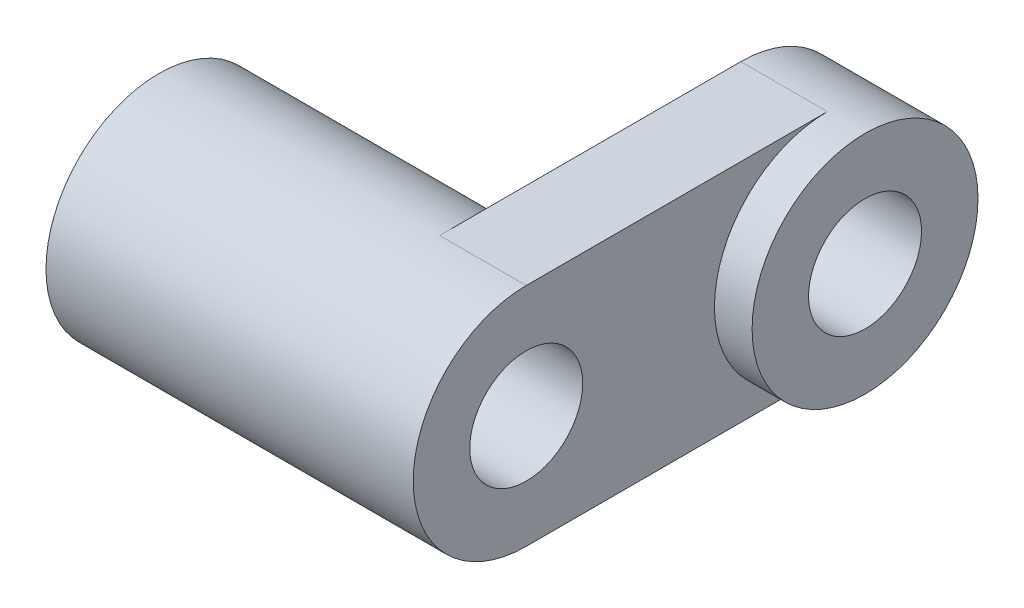
ISO-10303-21;
HEADER;
FILE_DESCRIPTION(('STEP AP214'),'2;1');
FILE_NAME('part.step','',(''),(''),'','','');
FILE_SCHEMA(('AUTOMOTIVE_DESIGN { 1 0 10303 214 1 1 1 1 }'));
ENDSEC;
DATA;
#1=APPLICATION_CONTEXT('core data for automotive mechanical design processes');
#2=APPLICATION_PROTOCOL_DEFINITION('international standard','automotive_design',2000,#1);
#3=PRODUCT_CONTEXT('',#1,'mechanical');
#4=PRODUCT('Part','Part','',(#3));
#5=PRODUCT_RELATED_PRODUCT_CATEGORY('part','',(#4));
#6=PRODUCT_DEFINITION_FORMATION('','',#4);
#7=PRODUCT_DEFINITION_CONTEXT('part definition',#1,'design');
#8=PRODUCT_DEFINITION('design','',#6,#7);
#9=PRODUCT_DEFINITION_SHAPE('','',#8);
#10=(LENGTH_UNIT() NAMED_UNIT(*) SI_UNIT(.MILLI.,.METRE.));
#11=(NAMED_UNIT(*) PLANE_ANGLE_UNIT() SI_UNIT($,.RADIAN.));
#12=(NAMED_UNIT(*) SI_UNIT($,.STERADIAN.) SOLID_ANGLE_UNIT());
#13=UNCERTAINTY_MEASURE_WITH_UNIT(LENGTH_MEASURE(1.E-05),#10,'distance_accuracy_value','');
#14=(GEOMETRIC_REPRESENTATION_CONTEXT(3) GLOBAL_UNCERTAINTY_ASSIGNED_CONTEXT((#13)) GLOBAL_UNIT_ASSIGNED_CONTEXT((#10,
#11,#12)) REPRESENTATION_CONTEXT('',''));
#15=CARTESIAN_POINT('',(0.,0.,0.));
#16=DIRECTION('',(0.,0.,1.));
#17=DIRECTION('',(1.,0.,0.));
#18=AXIS2_PLACEMENT_3D('',#15,#16,#17);
#19=CARTESIAN_POINT('',(0.,0.,0.));
#20=DIRECTION('',(1.,0.,0.));
#21=DIRECTION('',(0.,0.,-1.));
#22=AXIS2_PLACEMENT_3D('',#19,#20,#21);
#23=PLANE('',#22);
#24=CARTESIAN_POINT('',(0.,0.,-8.));
#25=DIRECTION('',(1.,0.,0.));
#26=DIRECTION('',(0.,0.,-1.));
#27=AXIS2_PLACEMENT_3D('',#24,#25,#26);
#28=CIRCLE('',#27,1.5);
#29=CARTESIAN_POINT('',(0.,0.,-9.50000000000001));
#30=VERTEX_POINT('',#29);
#31=EDGE_CURVE('E137',#30,#30,#28,.T.);
#32=ORIENTED_EDGE('',*,*,#31,.T.);
#33=EDGE_LOOP('',(#32));
#34=FACE_BOUND('',#33,.T.);
#35=CARTESIAN_POINT('',(0.,0.,0.));
#36=DIRECTION('',(-1.,0.,0.));
#37=DIRECTION('',(0.,0.,1.));
#38=AXIS2_PLACEMENT_3D('',#35,#36,#37);
#39=CIRCLE('',#38,3.);
#40=CARTESIAN_POINT('',(0.,3.,0.));
#41=VERTEX_POINT('',#40);
#42=CARTESIAN_POINT('',(0.,-3.,0.));
#43=VERTEX_POINT('',#42);
#44=EDGE_CURVE('E134',#41,#43,#39,.T.);
#45=ORIENTED_EDGE('',*,*,#44,.F.);
#46=DIRECTION('',(0.,0.,1.));
#47=VECTOR('',#46,1.);
#48=CARTESIAN_POINT('',(0.,3.,0.));
#49=LINE('',#48,#47);
#50=CARTESIAN_POINT('',(0.,3.,-8.));
#51=VERTEX_POINT('',#50);
#52=EDGE_CURVE('E123',#51,#41,#49,.T.);
#53=ORIENTED_EDGE('',*,*,#52,.F.);
#54=CARTESIAN_POINT('',(0.,0.,-8.));
#55=DIRECTION('',(1.,0.,0.));
#56=DIRECTION('',(0.,0.,-1.));
#57=AXIS2_PLACEMENT_3D('',#54,#55,#56);
#58=CIRCLE('',#57,3.);
#59=CARTESIAN_POINT('',(0.,-3.,-8.));
#60=VERTEX_POINT('',#59);
#61=EDGE_CURVE('E75',#60,#51,#58,.T.);
#62=ORIENTED_EDGE('',*,*,#61,.F.);
#63=DIRECTION('',(0.,0.,-1.));
#64=VECTOR('',#63,1.);
#65=CARTESIAN_POINT('',(0.,-3.,0.));
#66=LINE('',#65,#64);
#67=EDGE_CURVE('E69',#43,#60,#66,.T.);
#68=ORIENTED_EDGE('',*,*,#67,.F.);
#69=EDGE_LOOP('',(#45,#53,#62,#68));
#70=FACE_BOUND('',#69,.T.);
#71=ADVANCED_FACE('F35',(#34,#70),#23,.F.);
#72=CARTESIAN_POINT('',(2.3,0.,0.));
#73=DIRECTION('',(1.,0.,0.));
#74=DIRECTION('',(0.,0.,-1.));
#75=AXIS2_PLACEMENT_3D('',#72,#73,#74);
#76=PLANE('',#75);
#77=CARTESIAN_POINT('',(2.3,0.,-8.));
#78=DIRECTION('',(1.,0.,0.));
#79=DIRECTION('',(0.,0.,-1.));
#80=AXIS2_PLACEMENT_3D('',#77,#78,#79);
#81=CIRCLE('',#80,3.);
#82=CARTESIAN_POINT('',(2.3,3.,-8.));
#83=VERTEX_POINT('',#82);
#84=CARTESIAN_POINT('',(2.3,-3.,-8.));
#85=VERTEX_POINT('',#84);
#86=EDGE_CURVE('E95',#83,#85,#81,.T.);
#87=ORIENTED_EDGE('',*,*,#86,.F.);
#88=DIRECTION('',(0.,0.,1.));
#89=VECTOR('',#88,1.);
#90=CARTESIAN_POINT('',(2.3,3.,0.));
#91=LINE('',#90,#89);
#92=CARTESIAN_POINT('',(2.3,3.,0.));
#93=VERTEX_POINT('',#92);
#94=EDGE_CURVE('E54',#83,#93,#91,.T.);
#95=ORIENTED_EDGE('',*,*,#94,.T.);
#96=CARTESIAN_POINT('',(2.3,0.,0.));
#97=DIRECTION('',(1.,0.,0.));
#98=DIRECTION('',(0.,0.,-1.));
#99=AXIS2_PLACEMENT_3D('',#96,#97,#98);
#100=CIRCLE('',#99,3.);
#101=CARTESIAN_POINT('',(2.3,-3.,0.));
#102=VERTEX_POINT('',#101);
#103=EDGE_CURVE('E120',#93,#102,#100,.T.);
#104=ORIENTED_EDGE('',*,*,#103,.T.);
#105=DIRECTION('',(0.,0.,-1.));
#106=VECTOR('',#105,1.);
#107=CARTESIAN_POINT('',(2.3,-3.,0.));
#108=LINE('',#107,#106);
#109=EDGE_CURVE('E78',#102,#85,#108,.T.);
#110=ORIENTED_EDGE('',*,*,#109,.T.);
#111=EDGE_LOOP('',(#87,#95,#104,#110));
#112=FACE_BOUND('',#111,.T.);
#113=CARTESIAN_POINT('',(2.3,0.,0.));
#114=DIRECTION('',(1.,0.,0.));
#115=DIRECTION('',(0.,0.,-1.));
#116=AXIS2_PLACEMENT_3D('',#113,#114,#115);
#117=CIRCLE('',#116,1.5);
#118=CARTESIAN_POINT('',(2.3,0.,-1.5));
#119=VERTEX_POINT('',#118);
#120=EDGE_CURVE('E126',#119,#119,#117,.T.);
#121=ORIENTED_EDGE('',*,*,#120,.F.);
#122=EDGE_LOOP('',(#121));
#123=FACE_BOUND('',#122,.T.);
#124=ADVANCED_FACE('F97',(#112,#123),#76,.T.);
#125=CARTESIAN_POINT('',(2.3,0.,0.));
#126=DIRECTION('',(-1.,0.,0.));
#127=DIRECTION('',(0.,0.,1.));
#128=AXIS2_PLACEMENT_3D('',#125,#126,#127);
#129=CYLINDRICAL_SURFACE('',#128,3.);
#130=DIRECTION('',(-1.,0.,0.));
#131=VECTOR('',#130,1.);
#132=CARTESIAN_POINT('',(2.3,3.,0.));
#133=LINE('',#132,#131);
#134=EDGE_CURVE('E89',#93,#41,#133,.T.);
#135=ORIENTED_EDGE('',*,*,#134,.T.);
#136=ORIENTED_EDGE('',*,*,#44,.T.);
#137=DIRECTION('',(-1.,0.,0.));
#138=VECTOR('',#137,1.);
#139=CARTESIAN_POINT('',(2.3,-3.,0.));
#140=LINE('',#139,#138);
#141=EDGE_CURVE('E12',#102,#43,#140,.T.);
#142=ORIENTED_EDGE('',*,*,#141,.F.);
#143=ORIENTED_EDGE('',*,*,#103,.F.);
#144=EDGE_LOOP('',(#135,#136,#142,#143));
#145=FACE_BOUND('',#144,.T.);
#146=CARTESIAN_POINT('',(-7.455,0.,0.));
#147=DIRECTION('',(1.,0.,0.));
#148=DIRECTION('',(0.,0.,-1.));
#149=AXIS2_PLACEMENT_3D('',#146,#147,#148);
#150=CIRCLE('',#149,3.);
#151=CARTESIAN_POINT('',(-7.455,0.,-3.));
#152=VERTEX_POINT('',#151);
#153=EDGE_CURVE('E103',#152,#152,#150,.T.);
#154=ORIENTED_EDGE('',*,*,#153,.T.);
#155=EDGE_LOOP('',(#154));
#156=FACE_BOUND('',#155,.T.);
#157=ADVANCED_FACE('F37',(#145,#156),#129,.T.);
#158=CARTESIAN_POINT('',(2.3,-3.,0.));
#159=DIRECTION('',(0.,1.,0.));
#160=DIRECTION('',(0.,0.,1.));
#161=AXIS2_PLACEMENT_3D('',#158,#159,#160);
#162=PLANE('',#161);
#163=ORIENTED_EDGE('',*,*,#67,.T.);
#164=DIRECTION('',(-1.,0.,0.));
#165=VECTOR('',#164,1.);
#166=CARTESIAN_POINT('',(2.3,-3.,-8.));
#167=LINE('',#166,#165);
#168=EDGE_CURVE('E45',#85,#60,#167,.T.);
#169=ORIENTED_EDGE('',*,*,#168,.F.);
#170=ORIENTED_EDGE('',*,*,#109,.F.);
#171=ORIENTED_EDGE('',*,*,#141,.T.);
#172=EDGE_LOOP('',(#163,#169,#170,#171));
#173=FACE_BOUND('',#172,.T.);
#174=ADVANCED_FACE('F150',(#173),#162,.F.);
#175=CARTESIAN_POINT('',(2.3,0.,-8.));
#176=DIRECTION('',(-1.,0.,0.));
#177=DIRECTION('',(0.,0.,1.));
#178=AXIS2_PLACEMENT_3D('',#175,#176,#177);
#179=CYLINDRICAL_SURFACE('',#178,3.);
#180=ORIENTED_EDGE('',*,*,#61,.T.);
#181=DIRECTION('',(-1.,0.,0.));
#182=VECTOR('',#181,1.);
#183=CARTESIAN_POINT('',(2.3,3.,-8.));
#184=LINE('',#183,#182);
#185=EDGE_CURVE('E86',#83,#51,#184,.T.);
#186=ORIENTED_EDGE('',*,*,#185,.F.);
#187=ORIENTED_EDGE('',*,*,#86,.T.);
#188=ORIENTED_EDGE('',*,*,#168,.T.);
#189=EDGE_LOOP('',(#180,#186,#187,#188));
#190=FACE_BOUND('',#189,.T.);
#191=CARTESIAN_POINT('',(3.3,0.,-8.));
#192=DIRECTION('',(1.,0.,0.));
#193=DIRECTION('',(0.,0.,-1.));
#194=AXIS2_PLACEMENT_3D('',#191,#192,#193);
#195=CIRCLE('',#194,3.);
#196=CARTESIAN_POINT('',(3.3,0.,-11.));
#197=VERTEX_POINT('',#196);
#198=EDGE_CURVE('E99',#197,#197,#195,.T.);
#199=ORIENTED_EDGE('',*,*,#198,.F.);
#200=EDGE_LOOP('',(#199));
#201=FACE_BOUND('',#200,.T.);
#202=ADVANCED_FACE('F93',(#190,#201),#179,.T.);
#203=CARTESIAN_POINT('',(2.3,3.,0.));
#204=DIRECTION('',(0.,-1.,0.));
#205=DIRECTION('',(0.,0.,-1.));
#206=AXIS2_PLACEMENT_3D('',#203,#204,#205);
#207=PLANE('',#206);
#208=ORIENTED_EDGE('',*,*,#52,.T.);
#209=ORIENTED_EDGE('',*,*,#134,.F.);
#210=ORIENTED_EDGE('',*,*,#94,.F.);
#211=ORIENTED_EDGE('',*,*,#185,.T.);
#212=EDGE_LOOP('',(#208,#209,#210,#211));
#213=FACE_BOUND('',#212,.T.);
#214=ADVANCED_FACE('F85',(#213),#207,.F.);
#215=CARTESIAN_POINT('',(2.3,0.,0.));
#216=DIRECTION('',(-1.,0.,0.));
#217=DIRECTION('',(0.,0.,1.));
#218=AXIS2_PLACEMENT_3D('',#215,#216,#217);
#219=CYLINDRICAL_SURFACE('',#218,1.5);
#220=ORIENTED_EDGE('',*,*,#120,.T.);
#221=EDGE_LOOP('',(#220));
#222=FACE_BOUND('',#221,.T.);
#223=CARTESIAN_POINT('',(-7.455,0.,0.));
#224=DIRECTION('',(1.,0.,0.));
#225=DIRECTION('',(0.,0.,-1.));
#226=AXIS2_PLACEMENT_3D('',#223,#224,#225);
#227=CIRCLE('',#226,1.5);
#228=CARTESIAN_POINT('',(-7.455,0.,-1.5));
#229=VERTEX_POINT('',#228);
#230=EDGE_CURVE('E136',#229,#229,#227,.T.);
#231=ORIENTED_EDGE('',*,*,#230,.F.);
#232=EDGE_LOOP('',(#231));
#233=FACE_BOUND('',#232,.T.);
#234=ADVANCED_FACE('F142',(#222,#233),#219,.F.);
#235=CARTESIAN_POINT('',(2.3,0.,-8.));
#236=DIRECTION('',(-1.,0.,0.));
#237=DIRECTION('',(0.,0.,1.));
#238=AXIS2_PLACEMENT_3D('',#235,#236,#237);
#239=CYLINDRICAL_SURFACE('',#238,1.5);
#240=ORIENTED_EDGE('',*,*,#31,.F.);
#241=EDGE_LOOP('',(#240));
#242=FACE_BOUND('',#241,.T.);
#243=CARTESIAN_POINT('',(3.3,0.,-8.));
#244=DIRECTION('',(1.,0.,0.));
#245=DIRECTION('',(0.,0.,-1.));
#246=AXIS2_PLACEMENT_3D('',#243,#244,#245);
#247=CIRCLE('',#246,1.5);
#248=CARTESIAN_POINT('',(3.3,0.,-9.50000000000001));
#249=VERTEX_POINT('',#248);
#250=EDGE_CURVE('E100',#249,#249,#247,.T.);
#251=ORIENTED_EDGE('',*,*,#250,.T.);
#252=EDGE_LOOP('',(#251));
#253=FACE_BOUND('',#252,.T.);
#254=ADVANCED_FACE('F180',(#242,#253),#239,.F.);
#255=CARTESIAN_POINT('',(-7.455,0.,0.));
#256=DIRECTION('',(1.,0.,0.));
#257=DIRECTION('',(0.,0.,-1.));
#258=AXIS2_PLACEMENT_3D('',#255,#256,#257);
#259=PLANE('',#258);
#260=ORIENTED_EDGE('',*,*,#230,.T.);
#261=EDGE_LOOP('',(#260));
#262=FACE_BOUND('',#261,.T.);
#263=ORIENTED_EDGE('',*,*,#153,.F.);
#264=EDGE_LOOP('',(#263));
#265=FACE_BOUND('',#264,.T.);
#266=ADVANCED_FACE('F186',(#262,#265),#259,.F.);
#267=CARTESIAN_POINT('',(3.3,0.,-8.));
#268=DIRECTION('',(1.,0.,0.));
#269=DIRECTION('',(0.,0.,-1.));
#270=AXIS2_PLACEMENT_3D('',#267,#268,#269);
#271=PLANE('',#270);
#272=ORIENTED_EDGE('',*,*,#198,.T.);
#273=EDGE_LOOP('',(#272));
#274=FACE_BOUND('',#273,.T.);
#275=ORIENTED_EDGE('',*,*,#250,.F.);
#276=EDGE_LOOP('',(#275));
#277=FACE_BOUND('',#276,.T.);
#278=ADVANCED_FACE('F193',(#274,#277),#271,.T.);
#279=CLOSED_SHELL('',(#71,#124,#157,#174,#202,#214,#234,#254,#266,#278));
#280=MANIFOLD_SOLID_BREP('B2',#279);
#281=ADVANCED_BREP_SHAPE_REPRESENTATION('',(#18,#280),#14);
#282=SHAPE_DEFINITION_REPRESENTATION(#9,#281);
ENDSEC;
END-ISO-10303-21;
